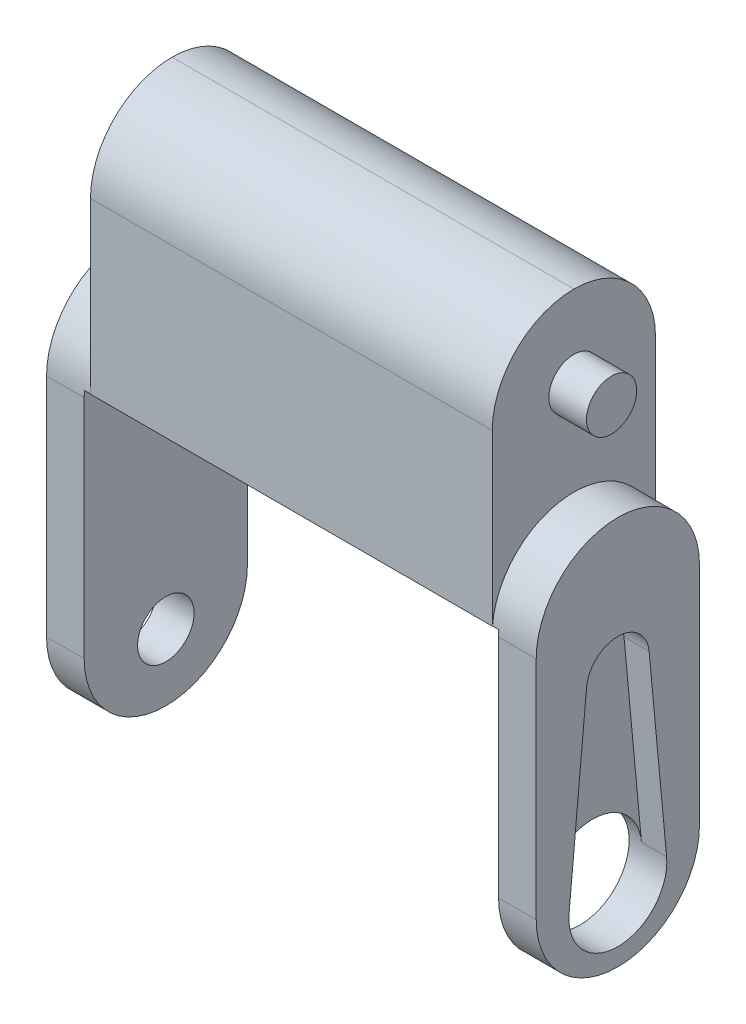
ISO-10303-21;
HEADER;
FILE_DESCRIPTION(('STEP AP214'),'2;1');
FILE_NAME('part.step','',(''),(''),'','','');
FILE_SCHEMA(('AUTOMOTIVE_DESIGN { 1 0 10303 214 1 1 1 1 }'));
ENDSEC;
DATA;
#1=APPLICATION_CONTEXT('core data for automotive mechanical design processes');
#2=APPLICATION_PROTOCOL_DEFINITION('international standard','automotive_design',2000,#1);
#3=PRODUCT_CONTEXT('',#1,'mechanical');
#4=PRODUCT('Part','Part','',(#3));
#5=PRODUCT_RELATED_PRODUCT_CATEGORY('part','',(#4));
#6=PRODUCT_DEFINITION_FORMATION('','',#4);
#7=PRODUCT_DEFINITION_CONTEXT('part definition',#1,'design');
#8=PRODUCT_DEFINITION('design','',#6,#7);
#9=PRODUCT_DEFINITION_SHAPE('','',#8);
#10=(LENGTH_UNIT() NAMED_UNIT(*) SI_UNIT(.MILLI.,.METRE.));
#11=(NAMED_UNIT(*) PLANE_ANGLE_UNIT() SI_UNIT($,.RADIAN.));
#12=(NAMED_UNIT(*) SI_UNIT($,.STERADIAN.) SOLID_ANGLE_UNIT());
#13=UNCERTAINTY_MEASURE_WITH_UNIT(LENGTH_MEASURE(1.E-05),#10,'distance_accuracy_value','');
#14=(GEOMETRIC_REPRESENTATION_CONTEXT(3) GLOBAL_UNCERTAINTY_ASSIGNED_CONTEXT((#13)) GLOBAL_UNIT_ASSIGNED_CONTEXT((#10,
#11,#12)) REPRESENTATION_CONTEXT('',''));
#15=CARTESIAN_POINT('',(0.,0.,0.));
#16=DIRECTION('',(0.,0.,1.));
#17=DIRECTION('',(1.,0.,0.));
#18=AXIS2_PLACEMENT_3D('',#15,#16,#17);
#19=CARTESIAN_POINT('',(36.,25.,13.));
#20=DIRECTION('',(1.,0.,0.));
#21=DIRECTION('',(0.,0.,-1.));
#22=AXIS2_PLACEMENT_3D('',#19,#20,#21);
#23=PLANE('',#22);
#24=CARTESIAN_POINT('',(36.,5.29398853892159,6.5));
#25=DIRECTION('',(-1.,0.,0.));
#26=DIRECTION('',(0.,-1.,0.));
#27=AXIS2_PLACEMENT_3D('',#24,#25,#26);
#28=CIRCLE('',#27,3.9);
#29=CARTESIAN_POINT('',(36.,1.39398853892159,6.5));
#30=VERTEX_POINT('',#29);
#31=EDGE_CURVE('E216',#30,#30,#28,.T.);
#32=ORIENTED_EDGE('',*,*,#31,.F.);
#33=EDGE_LOOP('',(#32));
#34=FACE_BOUND('',#33,.T.);
#35=CARTESIAN_POINT('',(36.,6.5,6.5));
#36=DIRECTION('',(1.,0.,0.));
#37=DIRECTION('',(0.,0.,-1.));
#38=AXIS2_PLACEMENT_3D('',#35,#36,#37);
#39=CIRCLE('',#38,6.5);
#40=CARTESIAN_POINT('',(36.,6.50000000000001,0.));
#41=VERTEX_POINT('',#40);
#42=CARTESIAN_POINT('',(36.,0.,6.5));
#43=VERTEX_POINT('',#42);
#44=EDGE_CURVE('E335',#41,#43,#39,.F.);
#45=ORIENTED_EDGE('',*,*,#44,.T.);
#46=CARTESIAN_POINT('',(36.,6.5,6.5));
#47=DIRECTION('',(1.,0.,0.));
#48=DIRECTION('',(0.,0.,-1.));
#49=AXIS2_PLACEMENT_3D('',#46,#47,#48);
#50=CIRCLE('',#49,6.5);
#51=CARTESIAN_POINT('',(36.,6.50000000000001,13.));
#52=VERTEX_POINT('',#51);
#53=EDGE_CURVE('E337',#43,#52,#50,.F.);
#54=ORIENTED_EDGE('',*,*,#53,.T.);
#55=DIRECTION('',(0.,-1.,0.));
#56=VECTOR('',#55,1.);
#57=CARTESIAN_POINT('',(36.,25.,13.));
#58=LINE('',#57,#56);
#59=CARTESIAN_POINT('',(36.,24.5,13.));
#60=VERTEX_POINT('',#59);
#61=EDGE_CURVE('E286',#60,#52,#58,.T.);
#62=ORIENTED_EDGE('',*,*,#61,.F.);
#63=CARTESIAN_POINT('',(36.,24.5,6.5));
#64=DIRECTION('',(1.,0.,0.));
#65=DIRECTION('',(0.,0.,-1.));
#66=AXIS2_PLACEMENT_3D('',#63,#64,#65);
#67=CIRCLE('',#66,6.5);
#68=CARTESIAN_POINT('',(36.,25.,12.9807406984079));
#69=VERTEX_POINT('',#68);
#70=EDGE_CURVE('E233',#60,#69,#67,.F.);
#71=ORIENTED_EDGE('',*,*,#70,.T.);
#72=DIRECTION('',(0.,0.,-1.));
#73=VECTOR('',#72,1.);
#74=CARTESIAN_POINT('',(36.,25.,13.));
#75=LINE('',#74,#73);
#76=CARTESIAN_POINT('',(36.,25.,0.0192593015921408));
#77=VERTEX_POINT('',#76);
#78=EDGE_CURVE('E295',#69,#77,#75,.T.);
#79=ORIENTED_EDGE('',*,*,#78,.T.);
#80=CARTESIAN_POINT('',(36.,24.5,0.));
#81=VERTEX_POINT('',#80);
#82=EDGE_CURVE('E227',#77,#81,#67,.F.);
#83=ORIENTED_EDGE('',*,*,#82,.T.);
#84=DIRECTION('',(0.,-1.,0.));
#85=VECTOR('',#84,1.);
#86=CARTESIAN_POINT('',(36.,25.,0.));
#87=LINE('',#86,#85);
#88=EDGE_CURVE('E303',#81,#41,#87,.T.);
#89=ORIENTED_EDGE('',*,*,#88,.T.);
#90=EDGE_LOOP('',(#45,#54,#62,#71,#79,#83,#89));
#91=FACE_BOUND('',#90,.T.);
#92=ADVANCED_FACE('F33',(#34,#91),#23,.F.);
#93=CARTESIAN_POINT('',(39.,0.,13.));
#94=DIRECTION('',(-1.,0.,0.));
#95=DIRECTION('',(0.,0.,1.));
#96=AXIS2_PLACEMENT_3D('',#93,#94,#95);
#97=PLANE('',#96);
#98=CARTESIAN_POINT('',(39.,5.29398853892159,6.5));
#99=DIRECTION('',(-1.,0.,0.));
#100=DIRECTION('',(0.,-1.,0.));
#101=AXIS2_PLACEMENT_3D('',#98,#99,#100);
#102=CIRCLE('',#101,3.9);
#103=CARTESIAN_POINT('',(39.,5.65798853892158,2.61702382186035));
#104=VERTEX_POINT('',#103);
#105=CARTESIAN_POINT('',(39.,5.65798853892158,10.3829761781397));
#106=VERTEX_POINT('',#105);
#107=EDGE_CURVE('E207',#104,#106,#102,.T.);
#108=ORIENTED_EDGE('',*,*,#107,.T.);
#109=DIRECTION('',(0.,-0.995634917471705,0.0933333333333336));
#110=VECTOR('',#109,1.);
#111=CARTESIAN_POINT('',(39.,20.5273218722549,8.98908729367926));
#112=LINE('',#111,#110);
#113=CARTESIAN_POINT('',(39.,20.5273218722549,8.98908729367926));
#114=VERTEX_POINT('',#113);
#115=EDGE_CURVE('E201',#114,#106,#112,.T.);
#116=ORIENTED_EDGE('',*,*,#115,.F.);
#117=CARTESIAN_POINT('',(39.,20.2939885389216,6.5));
#118=DIRECTION('',(1.,0.,0.));
#119=DIRECTION('',(0.,0.,-1.));
#120=AXIS2_PLACEMENT_3D('',#117,#118,#119);
#121=CIRCLE('',#120,2.5);
#122=CARTESIAN_POINT('',(39.,20.5273218722549,4.01091270632074));
#123=VERTEX_POINT('',#122);
#124=EDGE_CURVE('E668',#123,#114,#121,.T.);
#125=ORIENTED_EDGE('',*,*,#124,.F.);
#126=DIRECTION('',(0.,0.995634917471705,0.0933333333333336));
#127=VECTOR('',#126,1.);
#128=CARTESIAN_POINT('',(39.,5.65798853892158,2.61702382186035));
#129=LINE('',#128,#127);
#130=EDGE_CURVE('E670',#104,#123,#129,.T.);
#131=ORIENTED_EDGE('',*,*,#130,.F.);
#132=EDGE_LOOP('',(#108,#116,#125,#131));
#133=FACE_BOUND('',#132,.T.);
#134=DIRECTION('',(0.,1.,0.));
#135=VECTOR('',#134,1.);
#136=CARTESIAN_POINT('',(39.,0.,13.));
#137=LINE('',#136,#135);
#138=CARTESIAN_POINT('',(39.,6.5,13.));
#139=VERTEX_POINT('',#138);
#140=CARTESIAN_POINT('',(39.,24.5,13.));
#141=VERTEX_POINT('',#140);
#142=EDGE_CURVE('E289',#139,#141,#137,.T.);
#143=ORIENTED_EDGE('',*,*,#142,.F.);
#144=CARTESIAN_POINT('',(39.,6.5,6.5));
#145=DIRECTION('',(-1.,0.,0.));
#146=DIRECTION('',(0.,0.,1.));
#147=AXIS2_PLACEMENT_3D('',#144,#145,#146);
#148=CIRCLE('',#147,6.5);
#149=CARTESIAN_POINT('',(39.,0.,6.5));
#150=VERTEX_POINT('',#149);
#151=EDGE_CURVE('E333',#139,#150,#148,.F.);
#152=ORIENTED_EDGE('',*,*,#151,.T.);
#153=CARTESIAN_POINT('',(39.,6.5,6.5));
#154=DIRECTION('',(-1.,0.,0.));
#155=DIRECTION('',(0.,0.,1.));
#156=AXIS2_PLACEMENT_3D('',#153,#154,#155);
#157=CIRCLE('',#156,6.5);
#158=CARTESIAN_POINT('',(39.,6.5,0.));
#159=VERTEX_POINT('',#158);
#160=EDGE_CURVE('E331',#150,#159,#157,.F.);
#161=ORIENTED_EDGE('',*,*,#160,.T.);
#162=DIRECTION('',(0.,1.,0.));
#163=VECTOR('',#162,1.);
#164=CARTESIAN_POINT('',(39.,0.,0.));
#165=LINE('',#164,#163);
#166=CARTESIAN_POINT('',(39.,24.5,0.));
#167=VERTEX_POINT('',#166);
#168=EDGE_CURVE('E306',#159,#167,#165,.T.);
#169=ORIENTED_EDGE('',*,*,#168,.T.);
#170=CARTESIAN_POINT('',(39.,24.5,6.5));
#171=DIRECTION('',(-1.,0.,0.));
#172=DIRECTION('',(0.,0.,-1.));
#173=AXIS2_PLACEMENT_3D('',#170,#171,#172);
#174=CIRCLE('',#173,6.5);
#175=EDGE_CURVE('E220',#141,#167,#174,.T.);
#176=ORIENTED_EDGE('',*,*,#175,.F.);
#177=EDGE_LOOP('',(#143,#152,#161,#169,#176));
#178=FACE_BOUND('',#177,.T.);
#179=ADVANCED_FACE('F449',(#133,#178),#97,.F.);
#180=CARTESIAN_POINT('',(0.,0.,13.));
#181=DIRECTION('',(0.,0.,-1.));
#182=DIRECTION('',(-1.,0.,0.));
#183=AXIS2_PLACEMENT_3D('',#180,#181,#182);
#184=PLANE('',#183);
#185=DIRECTION('',(0.,1.,0.));
#186=VECTOR('',#185,1.);
#187=CARTESIAN_POINT('',(35.5,45.,13.));
#188=LINE('',#187,#186);
#189=CARTESIAN_POINT('',(35.5,25.,13.));
#190=VERTEX_POINT('',#189);
#191=CARTESIAN_POINT('',(35.5,38.5,13.));
#192=VERTEX_POINT('',#191);
#193=EDGE_CURVE('E291',#190,#192,#188,.T.);
#194=ORIENTED_EDGE('',*,*,#193,.T.);
#195=DIRECTION('',(-1.,0.,0.));
#196=VECTOR('',#195,1.);
#197=CARTESIAN_POINT('',(0.,38.5,13.));
#198=LINE('',#197,#196);
#199=CARTESIAN_POINT('',(3.49999999999999,38.5,13.));
#200=VERTEX_POINT('',#199);
#201=EDGE_CURVE('E41',#192,#200,#198,.T.);
#202=ORIENTED_EDGE('',*,*,#201,.T.);
#203=DIRECTION('',(0.,-1.,0.));
#204=VECTOR('',#203,1.);
#205=CARTESIAN_POINT('',(3.49999999999999,31.,13.));
#206=LINE('',#205,#204);
#207=CARTESIAN_POINT('',(3.5,25.,13.));
#208=VERTEX_POINT('',#207);
#209=EDGE_CURVE('E293',#200,#208,#206,.T.);
#210=ORIENTED_EDGE('',*,*,#209,.T.);
#211=DIRECTION('',(1.,0.,0.));
#212=VECTOR('',#211,1.);
#213=CARTESIAN_POINT('',(3.,25.,13.));
#214=LINE('',#213,#212);
#215=EDGE_CURVE('E283',#208,#190,#214,.T.);
#216=ORIENTED_EDGE('',*,*,#215,.T.);
#217=EDGE_LOOP('',(#194,#202,#210,#216));
#218=FACE_BOUND('',#217,.T.);
#219=ADVANCED_FACE('F380',(#218),#184,.F.);
#220=CARTESIAN_POINT('',(0.,0.,0.));
#221=DIRECTION('',(0.,0.,-1.));
#222=DIRECTION('',(-1.,0.,0.));
#223=AXIS2_PLACEMENT_3D('',#220,#221,#222);
#224=PLANE('',#223);
#225=DIRECTION('',(0.,-1.,0.));
#226=VECTOR('',#225,1.);
#227=CARTESIAN_POINT('',(3.49999999999999,31.,0.));
#228=LINE('',#227,#226);
#229=CARTESIAN_POINT('',(3.49999999999999,38.5,0.));
#230=VERTEX_POINT('',#229);
#231=CARTESIAN_POINT('',(3.5,25.,0.));
#232=VERTEX_POINT('',#231);
#233=EDGE_CURVE('E281',#230,#232,#228,.T.);
#234=ORIENTED_EDGE('',*,*,#233,.F.);
#235=DIRECTION('',(-1.,0.,0.));
#236=VECTOR('',#235,1.);
#237=CARTESIAN_POINT('',(35.5,38.5,0.));
#238=LINE('',#237,#236);
#239=CARTESIAN_POINT('',(35.5,38.5,0.));
#240=VERTEX_POINT('',#239);
#241=EDGE_CURVE('E358',#230,#240,#238,.F.);
#242=ORIENTED_EDGE('',*,*,#241,.T.);
#243=DIRECTION('',(0.,1.,0.));
#244=VECTOR('',#243,1.);
#245=CARTESIAN_POINT('',(35.5,45.,0.));
#246=LINE('',#245,#244);
#247=CARTESIAN_POINT('',(35.5,25.,0.));
#248=VERTEX_POINT('',#247);
#249=EDGE_CURVE('E308',#248,#240,#246,.T.);
#250=ORIENTED_EDGE('',*,*,#249,.F.);
#251=DIRECTION('',(1.,0.,0.));
#252=VECTOR('',#251,1.);
#253=CARTESIAN_POINT('',(3.,25.,0.));
#254=LINE('',#253,#252);
#255=EDGE_CURVE('E300',#232,#248,#254,.T.);
#256=ORIENTED_EDGE('',*,*,#255,.F.);
#257=EDGE_LOOP('',(#234,#242,#250,#256));
#258=FACE_BOUND('',#257,.T.);
#259=ADVANCED_FACE('F404',(#258),#224,.T.);
#260=CARTESIAN_POINT('',(0.,0.,13.));
#261=DIRECTION('',(1.,0.,0.));
#262=DIRECTION('',(0.,0.,-1.));
#263=AXIS2_PLACEMENT_3D('',#260,#261,#262);
#264=PLANE('',#263);
#265=CARTESIAN_POINT('',(0.,5.29398853892159,6.5));
#266=DIRECTION('',(-1.,0.,0.));
#267=DIRECTION('',(0.,0.,1.));
#268=AXIS2_PLACEMENT_3D('',#265,#266,#267);
#269=CIRCLE('',#268,2.25);
#270=CARTESIAN_POINT('',(0.,5.29398853892159,8.75));
#271=VERTEX_POINT('',#270);
#272=EDGE_CURVE('E270',#271,#271,#269,.T.);
#273=ORIENTED_EDGE('',*,*,#272,.F.);
#274=EDGE_LOOP('',(#273));
#275=FACE_BOUND('',#274,.T.);
#276=DIRECTION('',(0.,-1.,0.));
#277=VECTOR('',#276,1.);
#278=CARTESIAN_POINT('',(0.,0.,0.));
#279=LINE('',#278,#277);
#280=CARTESIAN_POINT('',(0.,24.5,0.));
#281=VERTEX_POINT('',#280);
#282=CARTESIAN_POINT('',(0.,6.5,0.));
#283=VERTEX_POINT('',#282);
#284=EDGE_CURVE('E274',#281,#283,#279,.T.);
#285=ORIENTED_EDGE('',*,*,#284,.T.);
#286=CARTESIAN_POINT('',(0.,6.5,6.5));
#287=DIRECTION('',(1.,0.,0.));
#288=DIRECTION('',(0.,0.,-1.));
#289=AXIS2_PLACEMENT_3D('',#286,#287,#288);
#290=CIRCLE('',#289,6.5);
#291=CARTESIAN_POINT('',(0.,0.,6.5));
#292=VERTEX_POINT('',#291);
#293=EDGE_CURVE('E350',#283,#292,#290,.F.);
#294=ORIENTED_EDGE('',*,*,#293,.T.);
#295=CARTESIAN_POINT('',(0.,6.5,6.5));
#296=DIRECTION('',(1.,0.,0.));
#297=DIRECTION('',(0.,0.,-1.));
#298=AXIS2_PLACEMENT_3D('',#295,#296,#297);
#299=CIRCLE('',#298,6.5);
#300=CARTESIAN_POINT('',(0.,6.5,13.));
#301=VERTEX_POINT('',#300);
#302=EDGE_CURVE('E348',#292,#301,#299,.F.);
#303=ORIENTED_EDGE('',*,*,#302,.T.);
#304=DIRECTION('',(0.,-1.,0.));
#305=VECTOR('',#304,1.);
#306=CARTESIAN_POINT('',(0.,0.,13.));
#307=LINE('',#306,#305);
#308=CARTESIAN_POINT('',(0.,24.5,13.));
#309=VERTEX_POINT('',#308);
#310=EDGE_CURVE('E277',#309,#301,#307,.T.);
#311=ORIENTED_EDGE('',*,*,#310,.F.);
#312=CARTESIAN_POINT('',(0.,24.5,6.5));
#313=DIRECTION('',(1.,0.,0.));
#314=DIRECTION('',(0.,0.,1.));
#315=AXIS2_PLACEMENT_3D('',#312,#313,#314);
#316=CIRCLE('',#315,6.5);
#317=EDGE_CURVE('E243',#281,#309,#316,.T.);
#318=ORIENTED_EDGE('',*,*,#317,.F.);
#319=EDGE_LOOP('',(#285,#294,#303,#311,#318));
#320=FACE_BOUND('',#319,.T.);
#321=ADVANCED_FACE('F424',(#275,#320),#264,.F.);
#322=CARTESIAN_POINT('',(3.,0.,13.));
#323=DIRECTION('',(-1.,0.,0.));
#324=DIRECTION('',(0.,0.,1.));
#325=AXIS2_PLACEMENT_3D('',#322,#323,#324);
#326=PLANE('',#325);
#327=CARTESIAN_POINT('',(3.,5.29398853892159,6.5));
#328=DIRECTION('',(-1.,0.,0.));
#329=DIRECTION('',(0.,0.,1.));
#330=AXIS2_PLACEMENT_3D('',#327,#328,#329);
#331=CIRCLE('',#330,2.25);
#332=CARTESIAN_POINT('',(3.,5.29398853892159,8.75));
#333=VERTEX_POINT('',#332);
#334=EDGE_CURVE('E271',#333,#333,#331,.T.);
#335=ORIENTED_EDGE('',*,*,#334,.T.);
#336=EDGE_LOOP('',(#335));
#337=FACE_BOUND('',#336,.T.);
#338=CARTESIAN_POINT('',(3.,6.5,6.5));
#339=DIRECTION('',(-1.,0.,0.));
#340=DIRECTION('',(0.,0.,1.));
#341=AXIS2_PLACEMENT_3D('',#338,#339,#340);
#342=CIRCLE('',#341,6.5);
#343=CARTESIAN_POINT('',(3.,6.5,13.));
#344=VERTEX_POINT('',#343);
#345=CARTESIAN_POINT('',(3.,0.,6.5));
#346=VERTEX_POINT('',#345);
#347=EDGE_CURVE('E341',#344,#346,#342,.F.);
#348=ORIENTED_EDGE('',*,*,#347,.T.);
#349=CARTESIAN_POINT('',(3.,6.5,6.5));
#350=DIRECTION('',(-1.,0.,0.));
#351=DIRECTION('',(0.,0.,1.));
#352=AXIS2_PLACEMENT_3D('',#349,#350,#351);
#353=CIRCLE('',#352,6.5);
#354=CARTESIAN_POINT('',(3.,6.5,0.));
#355=VERTEX_POINT('',#354);
#356=EDGE_CURVE('E343',#346,#355,#353,.F.);
#357=ORIENTED_EDGE('',*,*,#356,.T.);
#358=DIRECTION('',(0.,1.,0.));
#359=VECTOR('',#358,1.);
#360=CARTESIAN_POINT('',(3.,0.,0.));
#361=LINE('',#360,#359);
#362=CARTESIAN_POINT('',(3.,24.5,0.));
#363=VERTEX_POINT('',#362);
#364=EDGE_CURVE('E298',#355,#363,#361,.T.);
#365=ORIENTED_EDGE('',*,*,#364,.T.);
#366=CARTESIAN_POINT('',(3.,24.5,6.5));
#367=DIRECTION('',(-1.,0.,0.));
#368=DIRECTION('',(0.,0.,1.));
#369=AXIS2_PLACEMENT_3D('',#366,#367,#368);
#370=CIRCLE('',#369,6.5);
#371=CARTESIAN_POINT('',(3.,25.,0.0192593015921425));
#372=VERTEX_POINT('',#371);
#373=EDGE_CURVE('E257',#363,#372,#370,.F.);
#374=ORIENTED_EDGE('',*,*,#373,.T.);
#375=DIRECTION('',(0.,0.,-1.));
#376=VECTOR('',#375,1.);
#377=CARTESIAN_POINT('',(3.,25.,13.));
#378=LINE('',#377,#376);
#379=CARTESIAN_POINT('',(3.,25.,12.9807406984079));
#380=VERTEX_POINT('',#379);
#381=EDGE_CURVE('E314',#380,#372,#378,.T.);
#382=ORIENTED_EDGE('',*,*,#381,.F.);
#383=CARTESIAN_POINT('',(3.,24.5,13.));
#384=VERTEX_POINT('',#383);
#385=EDGE_CURVE('E253',#380,#384,#370,.F.);
#386=ORIENTED_EDGE('',*,*,#385,.T.);
#387=DIRECTION('',(0.,1.,0.));
#388=VECTOR('',#387,1.);
#389=CARTESIAN_POINT('',(3.,0.,13.));
#390=LINE('',#389,#388);
#391=EDGE_CURVE('E280',#344,#384,#390,.T.);
#392=ORIENTED_EDGE('',*,*,#391,.F.);
#393=EDGE_LOOP('',(#348,#357,#365,#374,#382,#386,#392));
#394=FACE_BOUND('',#393,.T.);
#395=ADVANCED_FACE('F412',(#337,#394),#326,.F.);
#396=ORIENTED_EDGE('',*,*,#310,.T.);
#397=DIRECTION('',(1.,0.,0.));
#398=VECTOR('',#397,1.);
#399=CARTESIAN_POINT('',(0.,6.5,13.));
#400=LINE('',#399,#398);
#401=EDGE_CURVE('E352',#301,#344,#400,.T.);
#402=ORIENTED_EDGE('',*,*,#401,.T.);
#403=ORIENTED_EDGE('',*,*,#391,.T.);
#404=DIRECTION('',(-1.,0.,0.));
#405=VECTOR('',#404,1.);
#406=CARTESIAN_POINT('',(19.7386372162328,24.5,13.));
#407=LINE('',#406,#405);
#408=EDGE_CURVE('E247',#384,#309,#407,.T.);
#409=ORIENTED_EDGE('',*,*,#408,.T.);
#410=EDGE_LOOP('',(#396,#402,#403,#409));
#411=FACE_BOUND('',#410,.T.);
#412=ADVANCED_FACE('F432',(#411),#184,.F.);
#413=ORIENTED_EDGE('',*,*,#364,.F.);
#414=DIRECTION('',(1.,0.,0.));
#415=VECTOR('',#414,1.);
#416=CARTESIAN_POINT('',(0.,6.5,0.));
#417=LINE('',#416,#415);
#418=EDGE_CURVE('E345',#355,#283,#417,.F.);
#419=ORIENTED_EDGE('',*,*,#418,.T.);
#420=ORIENTED_EDGE('',*,*,#284,.F.);
#421=DIRECTION('',(-1.,0.,0.));
#422=VECTOR('',#421,1.);
#423=CARTESIAN_POINT('',(19.7386372162328,24.5,0.));
#424=LINE('',#423,#422);
#425=EDGE_CURVE('E323',#281,#363,#424,.F.);
#426=ORIENTED_EDGE('',*,*,#425,.T.);
#427=EDGE_LOOP('',(#413,#419,#420,#426));
#428=FACE_BOUND('',#427,.T.);
#429=ADVANCED_FACE('F417',(#428),#224,.T.);
#430=CARTESIAN_POINT('',(3.,25.,13.));
#431=DIRECTION('',(0.,1.,0.));
#432=DIRECTION('',(0.,0.,1.));
#433=AXIS2_PLACEMENT_3D('',#430,#431,#432);
#434=PLANE('',#433);
#435=DIRECTION('',(1.,0.,0.));
#436=VECTOR('',#435,1.);
#437=CARTESIAN_POINT('',(18.9684807608978,25.,12.9807406984079));
#438=LINE('',#437,#436);
#439=CARTESIAN_POINT('',(35.5,25.,12.9807406984079));
#440=VERTEX_POINT('',#439);
#441=EDGE_CURVE('E236',#69,#440,#438,.F.);
#442=ORIENTED_EDGE('',*,*,#441,.T.);
#443=DIRECTION('',(0.,0.,1.));
#444=VECTOR('',#443,1.);
#445=CARTESIAN_POINT('',(35.5,25.,13.));
#446=LINE('',#445,#444);
#447=EDGE_CURVE('E239',#440,#190,#446,.T.);
#448=ORIENTED_EDGE('',*,*,#447,.T.);
#449=ORIENTED_EDGE('',*,*,#215,.F.);
#450=DIRECTION('',(0.,0.,-1.));
#451=VECTOR('',#450,1.);
#452=CARTESIAN_POINT('',(3.49999999999999,25.,13.));
#453=LINE('',#452,#451);
#454=CARTESIAN_POINT('',(3.5,25.,12.9807406984079));
#455=VERTEX_POINT('',#454);
#456=EDGE_CURVE('E263',#208,#455,#453,.T.);
#457=ORIENTED_EDGE('',*,*,#456,.T.);
#458=DIRECTION('',(-1.,0.,0.));
#459=VECTOR('',#458,1.);
#460=CARTESIAN_POINT('',(19.7386372162328,25.,12.9807406984079));
#461=LINE('',#460,#459);
#462=EDGE_CURVE('E250',#455,#380,#461,.T.);
#463=ORIENTED_EDGE('',*,*,#462,.T.);
#464=ORIENTED_EDGE('',*,*,#381,.T.);
#465=DIRECTION('',(-1.,0.,0.));
#466=VECTOR('',#465,1.);
#467=CARTESIAN_POINT('',(19.7386372162328,25.,0.0192593015921425));
#468=LINE('',#467,#466);
#469=CARTESIAN_POINT('',(3.5,25.,0.0192593015921408));
#470=VERTEX_POINT('',#469);
#471=EDGE_CURVE('E256',#372,#470,#468,.F.);
#472=ORIENTED_EDGE('',*,*,#471,.T.);
#473=EDGE_CURVE('E260',#470,#232,#453,.T.);
#474=ORIENTED_EDGE('',*,*,#473,.T.);
#475=ORIENTED_EDGE('',*,*,#255,.T.);
#476=CARTESIAN_POINT('',(35.5,25.,0.0192593015921408));
#477=VERTEX_POINT('',#476);
#478=EDGE_CURVE('E242',#248,#477,#446,.T.);
#479=ORIENTED_EDGE('',*,*,#478,.T.);
#480=DIRECTION('',(1.,0.,0.));
#481=VECTOR('',#480,1.);
#482=CARTESIAN_POINT('',(18.9684807608978,25.,0.0192593015921408));
#483=LINE('',#482,#481);
#484=EDGE_CURVE('E232',#477,#77,#483,.T.);
#485=ORIENTED_EDGE('',*,*,#484,.T.);
#486=ORIENTED_EDGE('',*,*,#78,.F.);
#487=EDGE_LOOP('',(#442,#448,#449,#457,#463,#464,#472,#474,#475,#479,#485,#486));
#488=FACE_BOUND('',#487,.T.);
#489=ADVANCED_FACE('F390',(#488),#434,.F.);
#490=CARTESIAN_POINT('',(35.5,45.,13.));
#491=DIRECTION('',(-1.,0.,0.));
#492=DIRECTION('',(0.,-1.,0.));
#493=AXIS2_PLACEMENT_3D('',#490,#491,#492);
#494=PLANE('',#493);
#495=ORIENTED_EDGE('',*,*,#249,.T.);
#496=CARTESIAN_POINT('',(35.5,38.5,6.5));
#497=DIRECTION('',(-1.,0.,0.));
#498=DIRECTION('',(0.,-1.,0.));
#499=AXIS2_PLACEMENT_3D('',#496,#497,#498);
#500=CIRCLE('',#499,6.5);
#501=CARTESIAN_POINT('',(35.5,45.,6.5));
#502=VERTEX_POINT('',#501);
#503=EDGE_CURVE('E362',#240,#502,#500,.F.);
#504=ORIENTED_EDGE('',*,*,#503,.T.);
#505=CARTESIAN_POINT('',(35.5,38.5,6.5));
#506=DIRECTION('',(-1.,0.,0.));
#507=DIRECTION('',(0.,-1.,0.));
#508=AXIS2_PLACEMENT_3D('',#505,#506,#507);
#509=CIRCLE('',#508,6.5);
#510=EDGE_CURVE('E55',#502,#192,#509,.F.);
#511=ORIENTED_EDGE('',*,*,#510,.T.);
#512=ORIENTED_EDGE('',*,*,#193,.F.);
#513=ORIENTED_EDGE('',*,*,#447,.F.);
#514=CARTESIAN_POINT('',(35.5,24.5,6.5));
#515=DIRECTION('',(-1.,0.,0.));
#516=DIRECTION('',(0.,-1.,0.));
#517=AXIS2_PLACEMENT_3D('',#514,#515,#516);
#518=CIRCLE('',#517,6.5);
#519=EDGE_CURVE('E225',#440,#477,#518,.T.);
#520=ORIENTED_EDGE('',*,*,#519,.T.);
#521=ORIENTED_EDGE('',*,*,#478,.F.);
#522=EDGE_LOOP('',(#495,#504,#511,#512,#513,#520,#521));
#523=FACE_BOUND('',#522,.T.);
#524=CARTESIAN_POINT('',(35.5,38.5,6.5));
#525=DIRECTION('',(-1.,0.,0.));
#526=DIRECTION('',(0.,-1.,0.));
#527=AXIS2_PLACEMENT_3D('',#524,#525,#526);
#528=CIRCLE('',#527,2.);
#529=CARTESIAN_POINT('',(35.5,36.5,6.5));
#530=VERTEX_POINT('',#529);
#531=EDGE_CURVE('E320',#530,#530,#528,.F.);
#532=ORIENTED_EDGE('',*,*,#531,.F.);
#533=EDGE_LOOP('',(#532));
#534=FACE_BOUND('',#533,.T.);
#535=ADVANCED_FACE('F393',(#523,#534),#494,.F.);
#536=CARTESIAN_POINT('',(3.49999999999999,31.,13.));
#537=DIRECTION('',(1.,0.,0.));
#538=DIRECTION('',(0.,0.,-1.));
#539=AXIS2_PLACEMENT_3D('',#536,#537,#538);
#540=PLANE('',#539);
#541=CARTESIAN_POINT('',(3.49999999999999,38.5,6.5));
#542=DIRECTION('',(1.,0.,0.));
#543=DIRECTION('',(0.,0.,-1.));
#544=AXIS2_PLACEMENT_3D('',#541,#542,#543);
#545=CIRCLE('',#544,6.5);
#546=CARTESIAN_POINT('',(3.49999999999999,45.,6.5));
#547=VERTEX_POINT('',#546);
#548=EDGE_CURVE('E354',#200,#547,#545,.F.);
#549=ORIENTED_EDGE('',*,*,#548,.T.);
#550=CARTESIAN_POINT('',(3.49999999999999,38.5,6.5));
#551=DIRECTION('',(1.,0.,0.));
#552=DIRECTION('',(0.,0.,-1.));
#553=AXIS2_PLACEMENT_3D('',#550,#551,#552);
#554=CIRCLE('',#553,6.5);
#555=EDGE_CURVE('E356',#547,#230,#554,.F.);
#556=ORIENTED_EDGE('',*,*,#555,.T.);
#557=ORIENTED_EDGE('',*,*,#233,.T.);
#558=ORIENTED_EDGE('',*,*,#473,.F.);
#559=CARTESIAN_POINT('',(3.5,24.5,6.5));
#560=DIRECTION('',(1.,0.,0.));
#561=DIRECTION('',(0.,0.,-1.));
#562=AXIS2_PLACEMENT_3D('',#559,#560,#561);
#563=CIRCLE('',#562,6.5);
#564=EDGE_CURVE('E245',#470,#455,#563,.T.);
#565=ORIENTED_EDGE('',*,*,#564,.T.);
#566=ORIENTED_EDGE('',*,*,#456,.F.);
#567=ORIENTED_EDGE('',*,*,#209,.F.);
#568=EDGE_LOOP('',(#549,#556,#557,#558,#565,#566,#567));
#569=FACE_BOUND('',#568,.T.);
#570=CARTESIAN_POINT('',(3.49999999999999,38.5,6.5));
#571=DIRECTION('',(1.,0.,0.));
#572=DIRECTION('',(0.,0.,-1.));
#573=AXIS2_PLACEMENT_3D('',#570,#571,#572);
#574=CIRCLE('',#573,2.);
#575=CARTESIAN_POINT('',(3.49999999999999,38.5,4.5));
#576=VERTEX_POINT('',#575);
#577=EDGE_CURVE('E317',#576,#576,#574,.F.);
#578=ORIENTED_EDGE('',*,*,#577,.F.);
#579=EDGE_LOOP('',(#578));
#580=FACE_BOUND('',#579,.T.);
#581=ADVANCED_FACE('F383',(#569,#580),#540,.F.);
#582=ORIENTED_EDGE('',*,*,#61,.T.);
#583=DIRECTION('',(1.,0.,0.));
#584=VECTOR('',#583,1.);
#585=CARTESIAN_POINT('',(0.,6.5,13.));
#586=LINE('',#585,#584);
#587=EDGE_CURVE('E328',#52,#139,#586,.T.);
#588=ORIENTED_EDGE('',*,*,#587,.T.);
#589=ORIENTED_EDGE('',*,*,#142,.T.);
#590=DIRECTION('',(1.,0.,0.));
#591=VECTOR('',#590,1.);
#592=CARTESIAN_POINT('',(18.9684807608978,24.5,13.));
#593=LINE('',#592,#591);
#594=EDGE_CURVE('E223',#60,#141,#593,.T.);
#595=ORIENTED_EDGE('',*,*,#594,.F.);
#596=EDGE_LOOP('',(#582,#588,#589,#595));
#597=FACE_BOUND('',#596,.T.);
#598=ADVANCED_FACE('F436',(#597),#184,.F.);
#599=ORIENTED_EDGE('',*,*,#168,.F.);
#600=DIRECTION('',(1.,0.,0.));
#601=VECTOR('',#600,1.);
#602=CARTESIAN_POINT('',(36.,6.5,0.));
#603=LINE('',#602,#601);
#604=EDGE_CURVE('E339',#159,#41,#603,.F.);
#605=ORIENTED_EDGE('',*,*,#604,.T.);
#606=ORIENTED_EDGE('',*,*,#88,.F.);
#607=DIRECTION('',(1.,0.,0.));
#608=VECTOR('',#607,1.);
#609=CARTESIAN_POINT('',(18.9684807608978,24.5,0.));
#610=LINE('',#609,#608);
#611=EDGE_CURVE('E326',#167,#81,#610,.F.);
#612=ORIENTED_EDGE('',*,*,#611,.F.);
#613=EDGE_LOOP('',(#599,#605,#606,#612));
#614=FACE_BOUND('',#613,.T.);
#615=ADVANCED_FACE('F442',(#614),#224,.T.);
#616=CARTESIAN_POINT('',(3.,5.29398853892159,6.5));
#617=DIRECTION('',(-1.,0.,0.));
#618=DIRECTION('',(0.,0.,1.));
#619=AXIS2_PLACEMENT_3D('',#616,#617,#618);
#620=CYLINDRICAL_SURFACE('',#619,2.25);
#621=ORIENTED_EDGE('',*,*,#334,.F.);
#622=EDGE_LOOP('',(#621));
#623=FACE_BOUND('',#622,.T.);
#624=ORIENTED_EDGE('',*,*,#272,.T.);
#625=EDGE_LOOP('',(#624));
#626=FACE_BOUND('',#625,.T.);
#627=ADVANCED_FACE('F548',(#623,#626),#620,.F.);
#628=CARTESIAN_POINT('',(0.499999999999994,38.5,6.5));
#629=DIRECTION('',(1.,0.,0.));
#630=DIRECTION('',(0.,0.,-1.));
#631=AXIS2_PLACEMENT_3D('',#628,#629,#630);
#632=CYLINDRICAL_SURFACE('',#631,2.);
#633=CARTESIAN_POINT('',(0.499999999999994,38.5,6.5));
#634=DIRECTION('',(-1.,0.,0.));
#635=DIRECTION('',(0.,0.,1.));
#636=AXIS2_PLACEMENT_3D('',#633,#634,#635);
#637=CIRCLE('',#636,2.);
#638=CARTESIAN_POINT('',(0.499999999999994,38.5,8.5));
#639=VERTEX_POINT('',#638);
#640=EDGE_CURVE('E267',#639,#639,#637,.T.);
#641=ORIENTED_EDGE('',*,*,#640,.F.);
#642=EDGE_LOOP('',(#641));
#643=FACE_BOUND('',#642,.T.);
#644=ORIENTED_EDGE('',*,*,#577,.T.);
#645=EDGE_LOOP('',(#644));
#646=FACE_BOUND('',#645,.T.);
#647=ADVANCED_FACE('F540',(#643,#646),#632,.T.);
#648=CARTESIAN_POINT('',(0.499999999999994,38.5,6.5));
#649=DIRECTION('',(-1.,0.,0.));
#650=DIRECTION('',(0.,0.,1.));
#651=AXIS2_PLACEMENT_3D('',#648,#649,#650);
#652=PLANE('',#651);
#653=ORIENTED_EDGE('',*,*,#640,.T.);
#654=EDGE_LOOP('',(#653));
#655=FACE_BOUND('',#654,.T.);
#656=ADVANCED_FACE('F532',(#655),#652,.T.);
#657=CARTESIAN_POINT('',(38.5,38.5,6.5));
#658=DIRECTION('',(-1.,0.,0.));
#659=DIRECTION('',(0.,-1.,0.));
#660=AXIS2_PLACEMENT_3D('',#657,#658,#659);
#661=CYLINDRICAL_SURFACE('',#660,2.);
#662=CARTESIAN_POINT('',(38.5,38.5,6.5));
#663=DIRECTION('',(1.,0.,0.));
#664=DIRECTION('',(0.,1.,0.));
#665=AXIS2_PLACEMENT_3D('',#662,#663,#664);
#666=CIRCLE('',#665,2.);
#667=CARTESIAN_POINT('',(38.5,40.5,6.5));
#668=VERTEX_POINT('',#667);
#669=EDGE_CURVE('E264',#668,#668,#666,.T.);
#670=ORIENTED_EDGE('',*,*,#669,.F.);
#671=EDGE_LOOP('',(#670));
#672=FACE_BOUND('',#671,.T.);
#673=ORIENTED_EDGE('',*,*,#531,.T.);
#674=EDGE_LOOP('',(#673));
#675=FACE_BOUND('',#674,.T.);
#676=ADVANCED_FACE('F524',(#672,#675),#661,.T.);
#677=CARTESIAN_POINT('',(38.5,38.5,6.5));
#678=DIRECTION('',(1.,0.,0.));
#679=DIRECTION('',(0.,1.,0.));
#680=AXIS2_PLACEMENT_3D('',#677,#678,#679);
#681=PLANE('',#680);
#682=ORIENTED_EDGE('',*,*,#669,.T.);
#683=EDGE_LOOP('',(#682));
#684=FACE_BOUND('',#683,.T.);
#685=ADVANCED_FACE('F517',(#684),#681,.T.);
#686=CARTESIAN_POINT('',(19.7386372162328,24.5,6.5));
#687=DIRECTION('',(-1.,0.,0.));
#688=DIRECTION('',(0.,0.,1.));
#689=AXIS2_PLACEMENT_3D('',#686,#687,#688);
#690=CYLINDRICAL_SURFACE('',#689,6.5);
#691=ORIENTED_EDGE('',*,*,#425,.F.);
#692=ORIENTED_EDGE('',*,*,#317,.T.);
#693=ORIENTED_EDGE('',*,*,#408,.F.);
#694=ORIENTED_EDGE('',*,*,#385,.F.);
#695=ORIENTED_EDGE('',*,*,#462,.F.);
#696=ORIENTED_EDGE('',*,*,#564,.F.);
#697=ORIENTED_EDGE('',*,*,#471,.F.);
#698=ORIENTED_EDGE('',*,*,#373,.F.);
#699=EDGE_LOOP('',(#691,#692,#693,#694,#695,#696,#697,#698));
#700=FACE_BOUND('',#699,.T.);
#701=ADVANCED_FACE('F410',(#700),#690,.T.);
#702=CARTESIAN_POINT('',(18.9684807608978,24.5,6.5));
#703=DIRECTION('',(1.,0.,0.));
#704=DIRECTION('',(0.,0.,-1.));
#705=AXIS2_PLACEMENT_3D('',#702,#703,#704);
#706=CYLINDRICAL_SURFACE('',#705,6.5);
#707=ORIENTED_EDGE('',*,*,#70,.F.);
#708=ORIENTED_EDGE('',*,*,#594,.T.);
#709=ORIENTED_EDGE('',*,*,#175,.T.);
#710=ORIENTED_EDGE('',*,*,#611,.T.);
#711=ORIENTED_EDGE('',*,*,#82,.F.);
#712=ORIENTED_EDGE('',*,*,#484,.F.);
#713=ORIENTED_EDGE('',*,*,#519,.F.);
#714=ORIENTED_EDGE('',*,*,#441,.F.);
#715=EDGE_LOOP('',(#707,#708,#709,#710,#711,#712,#713,#714));
#716=FACE_BOUND('',#715,.T.);
#717=ADVANCED_FACE('F398',(#716),#706,.T.);
#718=CARTESIAN_POINT('',(36.,6.5,6.5));
#719=DIRECTION('',(-1.,0.,0.));
#720=DIRECTION('',(0.,0.,1.));
#721=AXIS2_PLACEMENT_3D('',#718,#719,#720);
#722=CYLINDRICAL_SURFACE('',#721,6.5);
#723=DIRECTION('',(1.,0.,0.));
#724=VECTOR('',#723,1.);
#725=CARTESIAN_POINT('',(39.,0.,6.5));
#726=LINE('',#725,#724);
#727=EDGE_CURVE('E224',#43,#150,#726,.T.);
#728=ORIENTED_EDGE('',*,*,#727,.F.);
#729=ORIENTED_EDGE('',*,*,#44,.F.);
#730=ORIENTED_EDGE('',*,*,#604,.F.);
#731=ORIENTED_EDGE('',*,*,#160,.F.);
#732=EDGE_LOOP('',(#728,#729,#730,#731));
#733=FACE_BOUND('',#732,.T.);
#734=ADVANCED_FACE('F470',(#733),#722,.T.);
#735=CARTESIAN_POINT('',(0.,6.5,6.5));
#736=DIRECTION('',(1.,0.,0.));
#737=DIRECTION('',(0.,0.,-1.));
#738=AXIS2_PLACEMENT_3D('',#735,#736,#737);
#739=CYLINDRICAL_SURFACE('',#738,6.5);
#740=ORIENTED_EDGE('',*,*,#53,.F.);
#741=ORIENTED_EDGE('',*,*,#727,.T.);
#742=ORIENTED_EDGE('',*,*,#151,.F.);
#743=ORIENTED_EDGE('',*,*,#587,.F.);
#744=EDGE_LOOP('',(#740,#741,#742,#743));
#745=FACE_BOUND('',#744,.T.);
#746=ADVANCED_FACE('F467',(#745),#739,.T.);
#747=CARTESIAN_POINT('',(0.,6.5,6.5));
#748=DIRECTION('',(1.,0.,0.));
#749=DIRECTION('',(0.,0.,-1.));
#750=AXIS2_PLACEMENT_3D('',#747,#748,#749);
#751=CYLINDRICAL_SURFACE('',#750,6.5);
#752=ORIENTED_EDGE('',*,*,#401,.F.);
#753=ORIENTED_EDGE('',*,*,#302,.F.);
#754=DIRECTION('',(1.,0.,0.));
#755=VECTOR('',#754,1.);
#756=CARTESIAN_POINT('',(0.,0.,6.5));
#757=LINE('',#756,#755);
#758=EDGE_CURVE('E367',#346,#292,#757,.F.);
#759=ORIENTED_EDGE('',*,*,#758,.F.);
#760=ORIENTED_EDGE('',*,*,#347,.F.);
#761=EDGE_LOOP('',(#752,#753,#759,#760));
#762=FACE_BOUND('',#761,.T.);
#763=ADVANCED_FACE('F428',(#762),#751,.T.);
#764=CARTESIAN_POINT('',(0.,6.5,6.5));
#765=DIRECTION('',(-1.,0.,0.));
#766=DIRECTION('',(0.,0.,1.));
#767=AXIS2_PLACEMENT_3D('',#764,#765,#766);
#768=CYLINDRICAL_SURFACE('',#767,6.5);
#769=ORIENTED_EDGE('',*,*,#293,.F.);
#770=ORIENTED_EDGE('',*,*,#418,.F.);
#771=ORIENTED_EDGE('',*,*,#356,.F.);
#772=ORIENTED_EDGE('',*,*,#758,.T.);
#773=EDGE_LOOP('',(#769,#770,#771,#772));
#774=FACE_BOUND('',#773,.T.);
#775=ADVANCED_FACE('F420',(#774),#768,.T.);
#776=CARTESIAN_POINT('',(0.,38.5,6.5));
#777=DIRECTION('',(-1.,0.,0.));
#778=DIRECTION('',(0.,0.,1.));
#779=AXIS2_PLACEMENT_3D('',#776,#777,#778);
#780=CYLINDRICAL_SURFACE('',#779,6.5);
#781=ORIENTED_EDGE('',*,*,#201,.F.);
#782=ORIENTED_EDGE('',*,*,#510,.F.);
#783=DIRECTION('',(-1.,0.,0.));
#784=VECTOR('',#783,1.);
#785=CARTESIAN_POINT('',(3.49999999999999,45.,6.5));
#786=LINE('',#785,#784);
#787=EDGE_CURVE('E215',#547,#502,#786,.F.);
#788=ORIENTED_EDGE('',*,*,#787,.F.);
#789=ORIENTED_EDGE('',*,*,#548,.F.);
#790=EDGE_LOOP('',(#781,#782,#788,#789));
#791=FACE_BOUND('',#790,.T.);
#792=ADVANCED_FACE('F35',(#791),#780,.T.);
#793=CARTESIAN_POINT('',(3.49999999999999,38.5,6.5));
#794=DIRECTION('',(1.,0.,0.));
#795=DIRECTION('',(0.,0.,-1.));
#796=AXIS2_PLACEMENT_3D('',#793,#794,#795);
#797=CYLINDRICAL_SURFACE('',#796,6.5);
#798=ORIENTED_EDGE('',*,*,#503,.F.);
#799=ORIENTED_EDGE('',*,*,#241,.F.);
#800=ORIENTED_EDGE('',*,*,#555,.F.);
#801=ORIENTED_EDGE('',*,*,#787,.T.);
#802=EDGE_LOOP('',(#798,#799,#800,#801));
#803=FACE_BOUND('',#802,.T.);
#804=ADVANCED_FACE('F373',(#803),#797,.T.);
#805=CARTESIAN_POINT('',(39.,5.29398853892159,6.5));
#806=DIRECTION('',(-1.,0.,0.));
#807=DIRECTION('',(0.,-1.,0.));
#808=AXIS2_PLACEMENT_3D('',#805,#806,#807);
#809=CYLINDRICAL_SURFACE('',#808,3.9);
#810=DIRECTION('',(1.,0.,0.));
#811=VECTOR('',#810,1.);
#812=CARTESIAN_POINT('',(37.,5.65798853892158,2.61702382186035));
#813=LINE('',#812,#811);
#814=CARTESIAN_POINT('',(37.,5.65798853892158,2.61702382186035));
#815=VERTEX_POINT('',#814);
#816=EDGE_CURVE('E196',#815,#104,#813,.T.);
#817=ORIENTED_EDGE('',*,*,#816,.F.);
#818=CARTESIAN_POINT('',(37.,5.29398853892159,6.5));
#819=DIRECTION('',(1.,0.,0.));
#820=DIRECTION('',(0.,0.,-1.));
#821=AXIS2_PLACEMENT_3D('',#818,#819,#820);
#822=CIRCLE('',#821,3.9);
#823=CARTESIAN_POINT('',(37.,5.65798853892158,10.3829761781397));
#824=VERTEX_POINT('',#823);
#825=EDGE_CURVE('E11',#824,#815,#822,.F.);
#826=ORIENTED_EDGE('',*,*,#825,.F.);
#827=DIRECTION('',(1.,0.,0.));
#828=VECTOR('',#827,1.);
#829=CARTESIAN_POINT('',(37.,5.65798853892158,10.3829761781397));
#830=LINE('',#829,#828);
#831=EDGE_CURVE('E219',#824,#106,#830,.T.);
#832=ORIENTED_EDGE('',*,*,#831,.T.);
#833=ORIENTED_EDGE('',*,*,#107,.F.);
#834=EDGE_LOOP('',(#817,#826,#832,#833));
#835=FACE_BOUND('',#834,.T.);
#836=ORIENTED_EDGE('',*,*,#31,.T.);
#837=EDGE_LOOP('',(#836));
#838=FACE_BOUND('',#837,.T.);
#839=ADVANCED_FACE('F204',(#835,#838),#809,.F.);
#840=CARTESIAN_POINT('',(37.,5.29398853892158,6.5));
#841=DIRECTION('',(1.,0.,0.));
#842=DIRECTION('',(0.,0.,-1.));
#843=AXIS2_PLACEMENT_3D('',#840,#841,#842);
#844=PLANE('',#843);
#845=ORIENTED_EDGE('',*,*,#825,.T.);
#846=DIRECTION('',(0.,0.995634917471705,0.0933333333333336));
#847=VECTOR('',#846,1.);
#848=CARTESIAN_POINT('',(37.,5.65798853892158,2.61702382186035));
#849=LINE('',#848,#847);
#850=CARTESIAN_POINT('',(37.,20.5273218722549,4.01091270632074));
#851=VERTEX_POINT('',#850);
#852=EDGE_CURVE('E189',#815,#851,#849,.T.);
#853=ORIENTED_EDGE('',*,*,#852,.T.);
#854=CARTESIAN_POINT('',(37.,20.2939885389216,6.5));
#855=DIRECTION('',(1.,0.,0.));
#856=DIRECTION('',(0.,0.,-1.));
#857=AXIS2_PLACEMENT_3D('',#854,#855,#856);
#858=CIRCLE('',#857,2.5);
#859=CARTESIAN_POINT('',(37.,20.5273218722549,8.98908729367926));
#860=VERTEX_POINT('',#859);
#861=EDGE_CURVE('E200',#851,#860,#858,.T.);
#862=ORIENTED_EDGE('',*,*,#861,.T.);
#863=DIRECTION('',(0.,-0.995634917471705,0.0933333333333336));
#864=VECTOR('',#863,1.);
#865=CARTESIAN_POINT('',(37.,20.5273218722549,8.98908729367926));
#866=LINE('',#865,#864);
#867=EDGE_CURVE('E47',#860,#824,#866,.T.);
#868=ORIENTED_EDGE('',*,*,#867,.T.);
#869=EDGE_LOOP('',(#845,#853,#862,#868));
#870=FACE_BOUND('',#869,.T.);
#871=ADVANCED_FACE('F188',(#870),#844,.T.);
#872=CARTESIAN_POINT('',(37.,20.5273218722549,8.98908729367926));
#873=DIRECTION('',(0.,0.0933333333333336,0.995634917471705));
#874=DIRECTION('',(0.,-0.995634917471705,0.0933333333333336));
#875=AXIS2_PLACEMENT_3D('',#872,#873,#874);
#876=PLANE('',#875);
#877=ORIENTED_EDGE('',*,*,#115,.T.);
#878=ORIENTED_EDGE('',*,*,#831,.F.);
#879=ORIENTED_EDGE('',*,*,#867,.F.);
#880=DIRECTION('',(1.,0.,0.));
#881=VECTOR('',#880,1.);
#882=CARTESIAN_POINT('',(37.,20.5273218722549,8.98908729367926));
#883=LINE('',#882,#881);
#884=EDGE_CURVE('E209',#860,#114,#883,.T.);
#885=ORIENTED_EDGE('',*,*,#884,.T.);
#886=EDGE_LOOP('',(#877,#878,#879,#885));
#887=FACE_BOUND('',#886,.T.);
#888=ADVANCED_FACE('F635',(#887),#876,.F.);
#889=CARTESIAN_POINT('',(37.,20.2939885389216,6.5));
#890=DIRECTION('',(1.,0.,0.));
#891=DIRECTION('',(0.,0.,-1.));
#892=AXIS2_PLACEMENT_3D('',#889,#890,#891);
#893=CYLINDRICAL_SURFACE('',#892,2.5);
#894=ORIENTED_EDGE('',*,*,#124,.T.);
#895=ORIENTED_EDGE('',*,*,#884,.F.);
#896=ORIENTED_EDGE('',*,*,#861,.F.);
#897=DIRECTION('',(1.,0.,0.));
#898=VECTOR('',#897,1.);
#899=CARTESIAN_POINT('',(37.,20.5273218722549,4.01091270632074));
#900=LINE('',#899,#898);
#901=EDGE_CURVE('E198',#851,#123,#900,.T.);
#902=ORIENTED_EDGE('',*,*,#901,.T.);
#903=EDGE_LOOP('',(#894,#895,#896,#902));
#904=FACE_BOUND('',#903,.T.);
#905=ADVANCED_FACE('F644',(#904),#893,.F.);
#906=CARTESIAN_POINT('',(37.,5.65798853892158,2.61702382186035));
#907=DIRECTION('',(0.,0.0933333333333336,-0.995634917471705));
#908=DIRECTION('',(0.,0.995634917471705,0.0933333333333336));
#909=AXIS2_PLACEMENT_3D('',#906,#907,#908);
#910=PLANE('',#909);
#911=ORIENTED_EDGE('',*,*,#130,.T.);
#912=ORIENTED_EDGE('',*,*,#901,.F.);
#913=ORIENTED_EDGE('',*,*,#852,.F.);
#914=ORIENTED_EDGE('',*,*,#816,.T.);
#915=EDGE_LOOP('',(#911,#912,#913,#914));
#916=FACE_BOUND('',#915,.T.);
#917=ADVANCED_FACE('F195',(#916),#910,.F.);
#918=CLOSED_SHELL('',(#92,#179,#219,#259,#321,#395,#412,#429,#489,#535,#581,#598,#615,#627,#647,
#656,#676,#685,#701,#717,#734,#746,#763,#775,#792,#804,#839,#871,#888,#905,#917));
#919=MANIFOLD_SOLID_BREP('B2',#918);
#920=ADVANCED_BREP_SHAPE_REPRESENTATION('',(#18,#919),#14);
#921=SHAPE_DEFINITION_REPRESENTATION(#9,#920);
ENDSEC;
END-ISO-10303-21;
